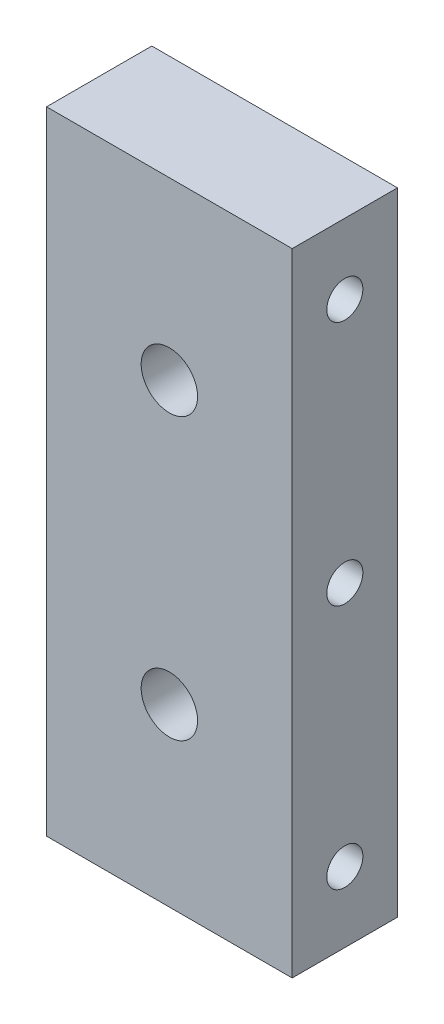
ISO-10303-21;
HEADER;
FILE_DESCRIPTION(('STEP AP214'),'2;1');
FILE_NAME('part.step','',(''),(''),'','','');
FILE_SCHEMA(('AUTOMOTIVE_DESIGN { 1 0 10303 214 1 1 1 1 }'));
ENDSEC;
DATA;
#1=APPLICATION_CONTEXT('core data for automotive mechanical design processes');
#2=APPLICATION_PROTOCOL_DEFINITION('international standard','automotive_design',2000,#1);
#3=PRODUCT_CONTEXT('',#1,'mechanical');
#4=PRODUCT('Part','Part','',(#3));
#5=PRODUCT_RELATED_PRODUCT_CATEGORY('part','',(#4));
#6=PRODUCT_DEFINITION_FORMATION('','',#4);
#7=PRODUCT_DEFINITION_CONTEXT('part definition',#1,'design');
#8=PRODUCT_DEFINITION('design','',#6,#7);
#9=PRODUCT_DEFINITION_SHAPE('','',#8);
#10=(LENGTH_UNIT() NAMED_UNIT(*) SI_UNIT(.MILLI.,.METRE.));
#11=(NAMED_UNIT(*) PLANE_ANGLE_UNIT() SI_UNIT($,.RADIAN.));
#12=(NAMED_UNIT(*) SI_UNIT($,.STERADIAN.) SOLID_ANGLE_UNIT());
#13=UNCERTAINTY_MEASURE_WITH_UNIT(LENGTH_MEASURE(1.E-05),#10,'distance_accuracy_value','');
#14=(GEOMETRIC_REPRESENTATION_CONTEXT(3) GLOBAL_UNCERTAINTY_ASSIGNED_CONTEXT((#13)) GLOBAL_UNIT_ASSIGNED_CONTEXT((#10,
#11,#12)) REPRESENTATION_CONTEXT('',''));
#15=CARTESIAN_POINT('',(0.,0.,0.));
#16=DIRECTION('',(0.,0.,1.));
#17=DIRECTION('',(1.,0.,0.));
#18=AXIS2_PLACEMENT_3D('',#15,#16,#17);
#19=CARTESIAN_POINT('',(23.8125,0.,25.4000000000001));
#20=DIRECTION('',(0.,0.,-1.));
#21=DIRECTION('',(-1.,0.,0.));
#22=AXIS2_PLACEMENT_3D('',#19,#20,#21);
#23=PLANE('',#22);
#24=CARTESIAN_POINT('',(12.7,238.125,25.4000000000001));
#25=DIRECTION('',(0.,0.,-1.));
#26=DIRECTION('',(-1.,0.,0.));
#27=AXIS2_PLACEMENT_3D('',#24,#25,#26);
#28=CIRCLE('',#27,2.55269999999999);
#29=CARTESIAN_POINT('',(10.1473,238.125,25.4000000000001));
#30=VERTEX_POINT('',#29);
#31=EDGE_CURVE('E162',#30,#30,#28,.T.);
#32=ORIENTED_EDGE('',*,*,#31,.F.);
#33=EDGE_LOOP('',(#32));
#34=FACE_BOUND('',#33,.T.);
#35=CARTESIAN_POINT('',(12.7,212.725,25.4000000000001));
#36=DIRECTION('',(0.,0.,-1.));
#37=DIRECTION('',(-1.,0.,0.));
#38=AXIS2_PLACEMENT_3D('',#35,#36,#37);
#39=CIRCLE('',#38,2.55269999999999);
#40=CARTESIAN_POINT('',(10.1473,212.725,25.4000000000001));
#41=VERTEX_POINT('',#40);
#42=EDGE_CURVE('E125',#41,#41,#39,.T.);
#43=ORIENTED_EDGE('',*,*,#42,.F.);
#44=EDGE_LOOP('',(#43));
#45=FACE_BOUND('',#44,.T.);
#46=DIRECTION('',(0.,-1.,0.));
#47=VECTOR('',#46,1.);
#48=CARTESIAN_POINT('',(1.5875,0.,25.4000000000001));
#49=LINE('',#48,#47);
#50=CARTESIAN_POINT('',(1.5875,254.,25.4));
#51=VERTEX_POINT('',#50);
#52=CARTESIAN_POINT('',(1.5875,196.85,25.4000000000001));
#53=VERTEX_POINT('',#52);
#54=EDGE_CURVE('E121',#51,#53,#49,.T.);
#55=ORIENTED_EDGE('',*,*,#54,.F.);
#56=DIRECTION('',(-1.,0.,0.));
#57=VECTOR('',#56,1.);
#58=CARTESIAN_POINT('',(23.8125,254.,25.4));
#59=LINE('',#58,#57);
#60=CARTESIAN_POINT('',(23.8125,254.,25.4));
#61=VERTEX_POINT('',#60);
#62=EDGE_CURVE('E11',#61,#51,#59,.T.);
#63=ORIENTED_EDGE('',*,*,#62,.F.);
#64=DIRECTION('',(0.,-1.,0.));
#65=VECTOR('',#64,1.);
#66=CARTESIAN_POINT('',(23.8125,0.,25.4000000000001));
#67=LINE('',#66,#65);
#68=CARTESIAN_POINT('',(23.8125,196.85,25.4000000000001));
#69=VERTEX_POINT('',#68);
#70=EDGE_CURVE('E93',#61,#69,#67,.T.);
#71=ORIENTED_EDGE('',*,*,#70,.T.);
#72=DIRECTION('',(-1.,0.,0.));
#73=VECTOR('',#72,1.);
#74=CARTESIAN_POINT('',(23.8125,196.85,25.4000000000001));
#75=LINE('',#74,#73);
#76=EDGE_CURVE('E81',#69,#53,#75,.T.);
#77=ORIENTED_EDGE('',*,*,#76,.T.);
#78=EDGE_LOOP('',(#55,#63,#71,#77));
#79=FACE_BOUND('',#78,.T.);
#80=ADVANCED_FACE('F41',(#34,#45,#79),#23,.T.);
#81=CARTESIAN_POINT('',(23.8125,254.,0.));
#82=DIRECTION('',(0.,-1.,0.));
#83=DIRECTION('',(0.,0.,-1.));
#84=AXIS2_PLACEMENT_3D('',#81,#82,#83);
#85=PLANE('',#84);
#86=DIRECTION('',(0.,0.,1.));
#87=VECTOR('',#86,1.);
#88=CARTESIAN_POINT('',(1.5875,254.,0.));
#89=LINE('',#88,#87);
#90=CARTESIAN_POINT('',(1.5875,254.,34.9250000000009));
#91=VERTEX_POINT('',#90);
#92=EDGE_CURVE('E99',#51,#91,#89,.T.);
#93=ORIENTED_EDGE('',*,*,#92,.T.);
#94=DIRECTION('',(-1.,0.,0.));
#95=VECTOR('',#94,1.);
#96=CARTESIAN_POINT('',(23.8125,254.,34.9250000000009));
#97=LINE('',#96,#95);
#98=CARTESIAN_POINT('',(23.8125,254.,34.9250000000009));
#99=VERTEX_POINT('',#98);
#100=EDGE_CURVE('E50',#99,#91,#97,.T.);
#101=ORIENTED_EDGE('',*,*,#100,.F.);
#102=DIRECTION('',(0.,0.,1.));
#103=VECTOR('',#102,1.);
#104=CARTESIAN_POINT('',(23.8125,254.,0.));
#105=LINE('',#104,#103);
#106=EDGE_CURVE('E87',#61,#99,#105,.T.);
#107=ORIENTED_EDGE('',*,*,#106,.F.);
#108=ORIENTED_EDGE('',*,*,#62,.T.);
#109=EDGE_LOOP('',(#93,#101,#107,#108));
#110=FACE_BOUND('',#109,.T.);
#111=ADVANCED_FACE('F97',(#110),#85,.F.);
#112=CARTESIAN_POINT('',(23.8125,0.,34.9250000000009));
#113=DIRECTION('',(0.,0.,-1.));
#114=DIRECTION('',(0.,1.,0.));
#115=AXIS2_PLACEMENT_3D('',#112,#113,#114);
#116=PLANE('',#115);
#117=CARTESIAN_POINT('',(12.7,238.125,34.9250000000009));
#118=DIRECTION('',(0.,0.,1.));
#119=DIRECTION('',(0.,-1.,0.));
#120=AXIS2_PLACEMENT_3D('',#117,#118,#119);
#121=CIRCLE('',#120,2.55269999999999);
#122=CARTESIAN_POINT('',(12.7,235.5723,34.9250000000009));
#123=VERTEX_POINT('',#122);
#124=EDGE_CURVE('E176',#123,#123,#121,.T.);
#125=ORIENTED_EDGE('',*,*,#124,.F.);
#126=EDGE_LOOP('',(#125));
#127=FACE_BOUND('',#126,.T.);
#128=CARTESIAN_POINT('',(12.7,212.725,34.9250000000009));
#129=DIRECTION('',(0.,0.,1.));
#130=DIRECTION('',(0.,-1.,0.));
#131=AXIS2_PLACEMENT_3D('',#128,#129,#130);
#132=CIRCLE('',#131,2.55269999999999);
#133=CARTESIAN_POINT('',(12.7,210.1723,34.9250000000009));
#134=VERTEX_POINT('',#133);
#135=EDGE_CURVE('E167',#134,#134,#132,.T.);
#136=ORIENTED_EDGE('',*,*,#135,.F.);
#137=EDGE_LOOP('',(#136));
#138=FACE_BOUND('',#137,.T.);
#139=DIRECTION('',(0.,-1.,0.));
#140=VECTOR('',#139,1.);
#141=CARTESIAN_POINT('',(1.5875,0.,34.9250000000009));
#142=LINE('',#141,#140);
#143=CARTESIAN_POINT('',(1.5875,196.85,34.9250000000009));
#144=VERTEX_POINT('',#143);
#145=EDGE_CURVE('E74',#91,#144,#142,.T.);
#146=ORIENTED_EDGE('',*,*,#145,.T.);
#147=DIRECTION('',(-1.,0.,0.));
#148=VECTOR('',#147,1.);
#149=CARTESIAN_POINT('',(23.8125,196.85,34.9250000000009));
#150=LINE('',#149,#148);
#151=CARTESIAN_POINT('',(23.8125,196.85,34.9250000000009));
#152=VERTEX_POINT('',#151);
#153=EDGE_CURVE('E101',#152,#144,#150,.T.);
#154=ORIENTED_EDGE('',*,*,#153,.F.);
#155=DIRECTION('',(0.,-1.,0.));
#156=VECTOR('',#155,1.);
#157=CARTESIAN_POINT('',(23.8125,0.,34.9250000000009));
#158=LINE('',#157,#156);
#159=EDGE_CURVE('E92',#99,#152,#158,.T.);
#160=ORIENTED_EDGE('',*,*,#159,.F.);
#161=ORIENTED_EDGE('',*,*,#100,.T.);
#162=EDGE_LOOP('',(#146,#154,#160,#161));
#163=FACE_BOUND('',#162,.T.);
#164=ADVANCED_FACE('F102',(#127,#138,#163),#116,.F.);
#165=CARTESIAN_POINT('',(23.8125,225.425,30.1625000000009));
#166=DIRECTION('',(-1.,0.,0.));
#167=DIRECTION('',(0.,0.,1.));
#168=AXIS2_PLACEMENT_3D('',#165,#166,#167);
#169=CYLINDRICAL_SURFACE('',#168,1.63195000000001);
#170=CARTESIAN_POINT('',(23.8125,225.425,30.1625000000009));
#171=DIRECTION('',(1.,0.,0.));
#172=DIRECTION('',(0.,0.,-1.));
#173=AXIS2_PLACEMENT_3D('',#170,#171,#172);
#174=CIRCLE('',#173,1.63195000000001);
#175=CARTESIAN_POINT('',(23.8125,225.425,28.5305500000009));
#176=VERTEX_POINT('',#175);
#177=EDGE_CURVE('E113',#176,#176,#174,.F.);
#178=ORIENTED_EDGE('',*,*,#177,.F.);
#179=EDGE_LOOP('',(#178));
#180=FACE_BOUND('',#179,.T.);
#181=CARTESIAN_POINT('',(1.5875,225.425,30.1625000000009));
#182=DIRECTION('',(1.,0.,0.));
#183=DIRECTION('',(0.,0.,-1.));
#184=AXIS2_PLACEMENT_3D('',#181,#182,#183);
#185=CIRCLE('',#184,1.63195000000001);
#186=CARTESIAN_POINT('',(1.5875,225.425,28.5305500000009));
#187=VERTEX_POINT('',#186);
#188=EDGE_CURVE('E137',#187,#187,#185,.F.);
#189=ORIENTED_EDGE('',*,*,#188,.T.);
#190=EDGE_LOOP('',(#189));
#191=FACE_BOUND('',#190,.T.);
#192=ADVANCED_FACE('F185',(#180,#191),#169,.F.);
#193=CARTESIAN_POINT('',(23.8125,203.2,30.1625000000009));
#194=DIRECTION('',(-1.,0.,0.));
#195=DIRECTION('',(0.,0.,1.));
#196=AXIS2_PLACEMENT_3D('',#193,#194,#195);
#197=CYLINDRICAL_SURFACE('',#196,1.63195000000001);
#198=CARTESIAN_POINT('',(23.8125,203.2,30.1625000000009));
#199=DIRECTION('',(1.,0.,0.));
#200=DIRECTION('',(0.,0.,-1.));
#201=AXIS2_PLACEMENT_3D('',#198,#199,#200);
#202=CIRCLE('',#201,1.63195000000001);
#203=CARTESIAN_POINT('',(23.8125,203.2,28.5305500000009));
#204=VERTEX_POINT('',#203);
#205=EDGE_CURVE('E106',#204,#204,#202,.F.);
#206=ORIENTED_EDGE('',*,*,#205,.F.);
#207=EDGE_LOOP('',(#206));
#208=FACE_BOUND('',#207,.T.);
#209=CARTESIAN_POINT('',(1.5875,203.2,30.1625000000009));
#210=DIRECTION('',(1.,0.,0.));
#211=DIRECTION('',(0.,0.,-1.));
#212=AXIS2_PLACEMENT_3D('',#209,#210,#211);
#213=CIRCLE('',#212,1.63195000000001);
#214=CARTESIAN_POINT('',(1.5875,203.2,28.5305500000009));
#215=VERTEX_POINT('',#214);
#216=EDGE_CURVE('E133',#215,#215,#213,.F.);
#217=ORIENTED_EDGE('',*,*,#216,.T.);
#218=EDGE_LOOP('',(#217));
#219=FACE_BOUND('',#218,.T.);
#220=ADVANCED_FACE('F208',(#208,#219),#197,.F.);
#221=CARTESIAN_POINT('',(23.8125,196.85,0.));
#222=DIRECTION('',(0.,1.,0.));
#223=DIRECTION('',(0.,0.,1.));
#224=AXIS2_PLACEMENT_3D('',#221,#222,#223);
#225=PLANE('',#224);
#226=DIRECTION('',(0.,0.,-1.));
#227=VECTOR('',#226,1.);
#228=CARTESIAN_POINT('',(1.5875,196.85,0.));
#229=LINE('',#228,#227);
#230=EDGE_CURVE('E130',#144,#53,#229,.T.);
#231=ORIENTED_EDGE('',*,*,#230,.T.);
#232=ORIENTED_EDGE('',*,*,#76,.F.);
#233=DIRECTION('',(0.,0.,-1.));
#234=VECTOR('',#233,1.);
#235=CARTESIAN_POINT('',(23.8125,196.85,0.));
#236=LINE('',#235,#234);
#237=EDGE_CURVE('E58',#152,#69,#236,.T.);
#238=ORIENTED_EDGE('',*,*,#237,.F.);
#239=ORIENTED_EDGE('',*,*,#153,.T.);
#240=EDGE_LOOP('',(#231,#232,#238,#239));
#241=FACE_BOUND('',#240,.T.);
#242=ADVANCED_FACE('F150',(#241),#225,.F.);
#243=CARTESIAN_POINT('',(23.8125,247.65,30.1625000000009));
#244=DIRECTION('',(-1.,0.,0.));
#245=DIRECTION('',(0.,0.,1.));
#246=AXIS2_PLACEMENT_3D('',#243,#244,#245);
#247=CYLINDRICAL_SURFACE('',#246,1.63195);
#248=CARTESIAN_POINT('',(23.8125,247.65,30.1625000000009));
#249=DIRECTION('',(1.,0.,0.));
#250=DIRECTION('',(0.,0.,-1.));
#251=AXIS2_PLACEMENT_3D('',#248,#249,#250);
#252=CIRCLE('',#251,1.63195);
#253=CARTESIAN_POINT('',(23.8125,247.65,28.5305500000009));
#254=VERTEX_POINT('',#253);
#255=EDGE_CURVE('E117',#254,#254,#252,.F.);
#256=ORIENTED_EDGE('',*,*,#255,.F.);
#257=EDGE_LOOP('',(#256));
#258=FACE_BOUND('',#257,.T.);
#259=CARTESIAN_POINT('',(1.5875,247.65,30.1625000000009));
#260=DIRECTION('',(1.,0.,0.));
#261=DIRECTION('',(0.,0.,-1.));
#262=AXIS2_PLACEMENT_3D('',#259,#260,#261);
#263=CIRCLE('',#262,1.63195);
#264=CARTESIAN_POINT('',(1.5875,247.65,28.5305500000009));
#265=VERTEX_POINT('',#264);
#266=EDGE_CURVE('E141',#265,#265,#263,.F.);
#267=ORIENTED_EDGE('',*,*,#266,.T.);
#268=EDGE_LOOP('',(#267));
#269=FACE_BOUND('',#268,.T.);
#270=ADVANCED_FACE('F201',(#258,#269),#247,.F.);
#271=CARTESIAN_POINT('',(23.8125,0.,0.));
#272=DIRECTION('',(1.,0.,0.));
#273=DIRECTION('',(0.,0.,-1.));
#274=AXIS2_PLACEMENT_3D('',#271,#272,#273);
#275=PLANE('',#274);
#276=ORIENTED_EDGE('',*,*,#70,.F.);
#277=ORIENTED_EDGE('',*,*,#106,.T.);
#278=ORIENTED_EDGE('',*,*,#159,.T.);
#279=ORIENTED_EDGE('',*,*,#237,.T.);
#280=EDGE_LOOP('',(#276,#277,#278,#279));
#281=FACE_BOUND('',#280,.T.);
#282=ORIENTED_EDGE('',*,*,#205,.T.);
#283=EDGE_LOOP('',(#282));
#284=FACE_BOUND('',#283,.T.);
#285=ORIENTED_EDGE('',*,*,#177,.T.);
#286=EDGE_LOOP('',(#285));
#287=FACE_BOUND('',#286,.T.);
#288=ORIENTED_EDGE('',*,*,#255,.T.);
#289=EDGE_LOOP('',(#288));
#290=FACE_BOUND('',#289,.T.);
#291=ADVANCED_FACE('F89',(#281,#284,#287,#290),#275,.T.);
#292=CARTESIAN_POINT('',(1.5875,0.,0.));
#293=DIRECTION('',(1.,0.,0.));
#294=DIRECTION('',(0.,0.,-1.));
#295=AXIS2_PLACEMENT_3D('',#292,#293,#294);
#296=PLANE('',#295);
#297=ORIENTED_EDGE('',*,*,#54,.T.);
#298=ORIENTED_EDGE('',*,*,#230,.F.);
#299=ORIENTED_EDGE('',*,*,#145,.F.);
#300=ORIENTED_EDGE('',*,*,#92,.F.);
#301=EDGE_LOOP('',(#297,#298,#299,#300));
#302=FACE_BOUND('',#301,.T.);
#303=ORIENTED_EDGE('',*,*,#216,.F.);
#304=EDGE_LOOP('',(#303));
#305=FACE_BOUND('',#304,.T.);
#306=ORIENTED_EDGE('',*,*,#188,.F.);
#307=EDGE_LOOP('',(#306));
#308=FACE_BOUND('',#307,.T.);
#309=ORIENTED_EDGE('',*,*,#266,.F.);
#310=EDGE_LOOP('',(#309));
#311=FACE_BOUND('',#310,.T.);
#312=ADVANCED_FACE('F152',(#302,#305,#308,#311),#296,.F.);
#313=CARTESIAN_POINT('',(12.7,212.725,34.9250000000009));
#314=DIRECTION('',(0.,0.,1.));
#315=DIRECTION('',(0.,-1.,0.));
#316=AXIS2_PLACEMENT_3D('',#313,#314,#315);
#317=CYLINDRICAL_SURFACE('',#316,2.55269999999999);
#318=ORIENTED_EDGE('',*,*,#42,.T.);
#319=EDGE_LOOP('',(#318));
#320=FACE_BOUND('',#319,.T.);
#321=ORIENTED_EDGE('',*,*,#135,.T.);
#322=EDGE_LOOP('',(#321));
#323=FACE_BOUND('',#322,.T.);
#324=ADVANCED_FACE('F189',(#320,#323),#317,.F.);
#325=CARTESIAN_POINT('',(12.7,238.125,34.9250000000009));
#326=DIRECTION('',(0.,0.,1.));
#327=DIRECTION('',(0.,-1.,0.));
#328=AXIS2_PLACEMENT_3D('',#325,#326,#327);
#329=CYLINDRICAL_SURFACE('',#328,2.55269999999999);
#330=ORIENTED_EDGE('',*,*,#31,.T.);
#331=EDGE_LOOP('',(#330));
#332=FACE_BOUND('',#331,.T.);
#333=ORIENTED_EDGE('',*,*,#124,.T.);
#334=EDGE_LOOP('',(#333));
#335=FACE_BOUND('',#334,.T.);
#336=ADVANCED_FACE('F181',(#332,#335),#329,.F.);
#337=CLOSED_SHELL('',(#80,#111,#164,#192,#220,#242,#270,#291,#312,#324,#336));
#338=MANIFOLD_SOLID_BREP('B2',#337);
#339=ADVANCED_BREP_SHAPE_REPRESENTATION('',(#18,#338),#14);
#340=SHAPE_DEFINITION_REPRESENTATION(#9,#339);
ENDSEC;
END-ISO-10303-21;
